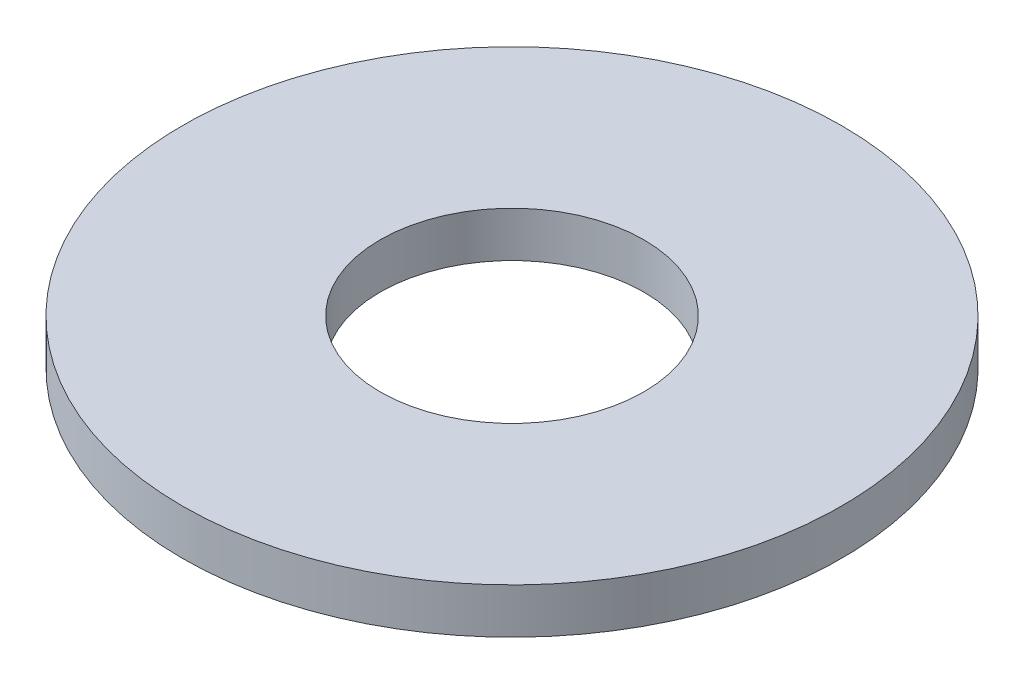
ISO-10303-21;
HEADER;
FILE_DESCRIPTION(('STEP AP214'),'2;1');
FILE_NAME('part.step','',(''),(''),'','','');
FILE_SCHEMA(('AUTOMOTIVE_DESIGN { 1 0 10303 214 1 1 1 1 }'));
ENDSEC;
DATA;
#1=APPLICATION_CONTEXT('core data for automotive mechanical design processes');
#2=APPLICATION_PROTOCOL_DEFINITION('international standard','automotive_design',2000,#1);
#3=PRODUCT_CONTEXT('',#1,'mechanical');
#4=PRODUCT('Part','Part','',(#3));
#5=PRODUCT_RELATED_PRODUCT_CATEGORY('part','',(#4));
#6=PRODUCT_DEFINITION_FORMATION('','',#4);
#7=PRODUCT_DEFINITION_CONTEXT('part definition',#1,'design');
#8=PRODUCT_DEFINITION('design','',#6,#7);
#9=PRODUCT_DEFINITION_SHAPE('','',#8);
#10=(LENGTH_UNIT() NAMED_UNIT(*) SI_UNIT(.MILLI.,.METRE.));
#11=(NAMED_UNIT(*) PLANE_ANGLE_UNIT() SI_UNIT($,.RADIAN.));
#12=(NAMED_UNIT(*) SI_UNIT($,.STERADIAN.) SOLID_ANGLE_UNIT());
#13=UNCERTAINTY_MEASURE_WITH_UNIT(LENGTH_MEASURE(1.E-05),#10,'distance_accuracy_value','');
#14=(GEOMETRIC_REPRESENTATION_CONTEXT(3) GLOBAL_UNCERTAINTY_ASSIGNED_CONTEXT((#13)) GLOBAL_UNIT_ASSIGNED_CONTEXT((#10,
#11,#12)) REPRESENTATION_CONTEXT('',''));
#15=CARTESIAN_POINT('',(0.,0.,0.));
#16=DIRECTION('',(0.,0.,1.));
#17=DIRECTION('',(1.,0.,0.));
#18=AXIS2_PLACEMENT_3D('',#15,#16,#17);
#19=CARTESIAN_POINT('',(0.,1.0922,0.));
#20=DIRECTION('',(0.,-1.,0.));
#21=DIRECTION('',(0.,0.,-1.));
#22=AXIS2_PLACEMENT_3D('',#19,#20,#21);
#23=CYLINDRICAL_SURFACE('',#22,7.9375);
#24=CARTESIAN_POINT('',(0.,1.0922,0.));
#25=DIRECTION('',(0.,1.,0.));
#26=DIRECTION('',(0.,0.,1.));
#27=AXIS2_PLACEMENT_3D('',#24,#25,#26);
#28=CIRCLE('',#27,7.9375);
#29=CARTESIAN_POINT('',(0.,1.0922,7.9375));
#30=VERTEX_POINT('',#29);
#31=EDGE_CURVE('E10',#30,#30,#28,.T.);
#32=ORIENTED_EDGE('',*,*,#31,.F.);
#33=EDGE_LOOP('',(#32));
#34=FACE_BOUND('',#33,.T.);
#35=CARTESIAN_POINT('',(0.,0.,0.));
#36=DIRECTION('',(0.,1.,0.));
#37=DIRECTION('',(0.,0.,1.));
#38=AXIS2_PLACEMENT_3D('',#35,#36,#37);
#39=CIRCLE('',#38,7.9375);
#40=CARTESIAN_POINT('',(0.,0.,7.9375));
#41=VERTEX_POINT('',#40);
#42=EDGE_CURVE('E36',#41,#41,#39,.T.);
#43=ORIENTED_EDGE('',*,*,#42,.T.);
#44=EDGE_LOOP('',(#43));
#45=FACE_BOUND('',#44,.T.);
#46=ADVANCED_FACE('F33',(#34,#45),#23,.T.);
#47=CARTESIAN_POINT('',(0.,1.0922,0.));
#48=DIRECTION('',(0.,1.,0.));
#49=DIRECTION('',(0.,0.,1.));
#50=AXIS2_PLACEMENT_3D('',#47,#48,#49);
#51=PLANE('',#50);
#52=CARTESIAN_POINT('',(0.,1.0922,0.));
#53=DIRECTION('',(0.,1.,0.));
#54=DIRECTION('',(0.,0.,1.));
#55=AXIS2_PLACEMENT_3D('',#52,#53,#54);
#56=CIRCLE('',#55,3.175);
#57=CARTESIAN_POINT('',(0.,1.0922,3.175));
#58=VERTEX_POINT('',#57);
#59=EDGE_CURVE('E45',#58,#58,#56,.T.);
#60=ORIENTED_EDGE('',*,*,#59,.F.);
#61=EDGE_LOOP('',(#60));
#62=FACE_BOUND('',#61,.T.);
#63=ORIENTED_EDGE('',*,*,#31,.T.);
#64=EDGE_LOOP('',(#63));
#65=FACE_BOUND('',#64,.T.);
#66=ADVANCED_FACE('F60',(#62,#65),#51,.T.);
#67=CARTESIAN_POINT('',(0.,0.,0.));
#68=DIRECTION('',(0.,1.,0.));
#69=DIRECTION('',(0.,0.,1.));
#70=AXIS2_PLACEMENT_3D('',#67,#68,#69);
#71=PLANE('',#70);
#72=CARTESIAN_POINT('',(0.,0.,0.));
#73=DIRECTION('',(0.,1.,0.));
#74=DIRECTION('',(0.,0.,1.));
#75=AXIS2_PLACEMENT_3D('',#72,#73,#74);
#76=CIRCLE('',#75,3.175);
#77=CARTESIAN_POINT('',(0.,0.,3.175));
#78=VERTEX_POINT('',#77);
#79=EDGE_CURVE('E43',#78,#78,#76,.T.);
#80=ORIENTED_EDGE('',*,*,#79,.T.);
#81=EDGE_LOOP('',(#80));
#82=FACE_BOUND('',#81,.T.);
#83=ORIENTED_EDGE('',*,*,#42,.F.);
#84=EDGE_LOOP('',(#83));
#85=FACE_BOUND('',#84,.T.);
#86=ADVANCED_FACE('F51',(#82,#85),#71,.F.);
#87=CARTESIAN_POINT('',(0.,0.,0.));
#88=DIRECTION('',(0.,1.,0.));
#89=DIRECTION('',(0.,0.,1.));
#90=AXIS2_PLACEMENT_3D('',#87,#88,#89);
#91=CYLINDRICAL_SURFACE('',#90,3.175);
#92=ORIENTED_EDGE('',*,*,#79,.F.);
#93=EDGE_LOOP('',(#92));
#94=FACE_BOUND('',#93,.T.);
#95=ORIENTED_EDGE('',*,*,#59,.T.);
#96=EDGE_LOOP('',(#95));
#97=FACE_BOUND('',#96,.T.);
#98=ADVANCED_FACE('F54',(#94,#97),#91,.F.);
#99=CLOSED_SHELL('',(#46,#66,#86,#98));
#100=MANIFOLD_SOLID_BREP('B2',#99);
#101=ADVANCED_BREP_SHAPE_REPRESENTATION('',(#18,#100),#14);
#102=SHAPE_DEFINITION_REPRESENTATION(#9,#101);
ENDSEC;
END-ISO-10303-21;
